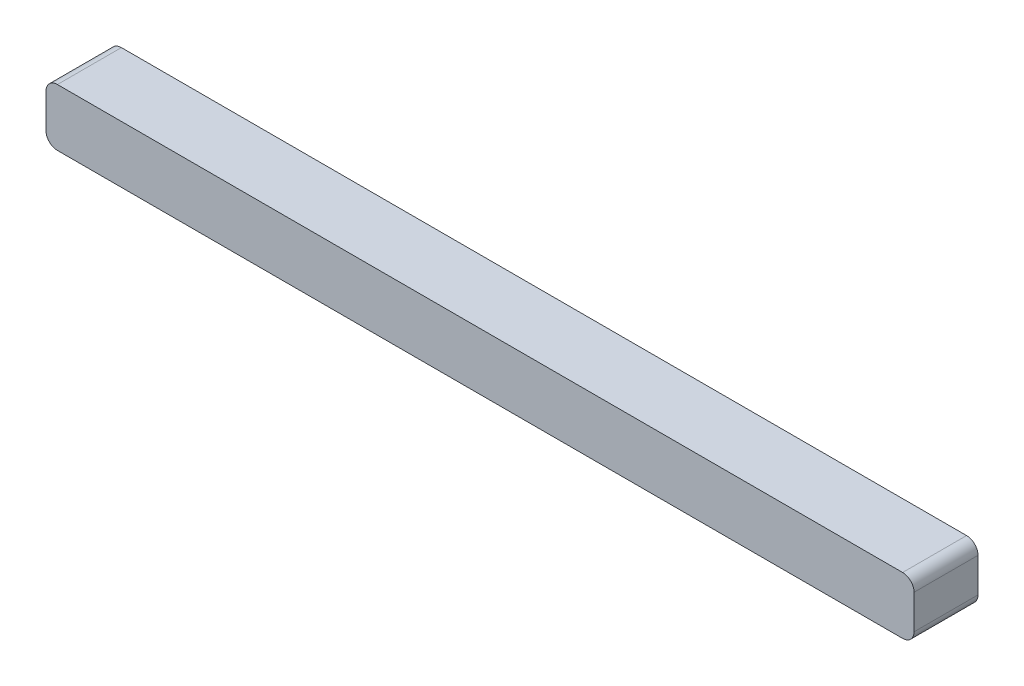
ISO-10303-21;
HEADER;
FILE_DESCRIPTION(('STEP AP214'),'2;1');
FILE_NAME('part.step','',(''),(''),'','','');
FILE_SCHEMA(('AUTOMOTIVE_DESIGN { 1 0 10303 214 1 1 1 1 }'));
ENDSEC;
DATA;
#1=APPLICATION_CONTEXT('core data for automotive mechanical design processes');
#2=APPLICATION_PROTOCOL_DEFINITION('international standard','automotive_design',2000,#1);
#3=PRODUCT_CONTEXT('',#1,'mechanical');
#4=PRODUCT('Part','Part','',(#3));
#5=PRODUCT_RELATED_PRODUCT_CATEGORY('part','',(#4));
#6=PRODUCT_DEFINITION_FORMATION('','',#4);
#7=PRODUCT_DEFINITION_CONTEXT('part definition',#1,'design');
#8=PRODUCT_DEFINITION('design','',#6,#7);
#9=PRODUCT_DEFINITION_SHAPE('','',#8);
#10=(LENGTH_UNIT() NAMED_UNIT(*) SI_UNIT(.MILLI.,.METRE.));
#11=(NAMED_UNIT(*) PLANE_ANGLE_UNIT() SI_UNIT($,.RADIAN.));
#12=(NAMED_UNIT(*) SI_UNIT($,.STERADIAN.) SOLID_ANGLE_UNIT());
#13=UNCERTAINTY_MEASURE_WITH_UNIT(LENGTH_MEASURE(1.E-05),#10,'distance_accuracy_value','');
#14=(GEOMETRIC_REPRESENTATION_CONTEXT(3) GLOBAL_UNCERTAINTY_ASSIGNED_CONTEXT((#13)) GLOBAL_UNIT_ASSIGNED_CONTEXT((#10,
#11,#12)) REPRESENTATION_CONTEXT('',''));
#15=CARTESIAN_POINT('',(0.,0.,0.));
#16=DIRECTION('',(0.,0.,1.));
#17=DIRECTION('',(1.,0.,0.));
#18=AXIS2_PLACEMENT_3D('',#15,#16,#17);
#19=CARTESIAN_POINT('',(-18.7,1.35,2.8));
#20=DIRECTION('',(1.,0.,0.));
#21=DIRECTION('',(0.,0.,-1.));
#22=AXIS2_PLACEMENT_3D('',#19,#20,#21);
#23=PLANE('',#22);
#24=DIRECTION('',(0.,-1.,0.));
#25=VECTOR('',#24,1.);
#26=CARTESIAN_POINT('',(-18.7,1.35,0.));
#27=LINE('',#26,#25);
#28=CARTESIAN_POINT('',(-18.7,0.85,0.));
#29=VERTEX_POINT('',#28);
#30=CARTESIAN_POINT('',(-18.7,-0.65,0.));
#31=VERTEX_POINT('',#30);
#32=EDGE_CURVE('E142',#29,#31,#27,.T.);
#33=ORIENTED_EDGE('',*,*,#32,.T.);
#34=DIRECTION('',(0.,0.,-1.));
#35=VECTOR('',#34,1.);
#36=CARTESIAN_POINT('',(-18.7,-0.65,2.8));
#37=LINE('',#36,#35);
#38=CARTESIAN_POINT('',(-18.7,-0.65,2.8));
#39=VERTEX_POINT('',#38);
#40=EDGE_CURVE('E116',#31,#39,#37,.F.);
#41=ORIENTED_EDGE('',*,*,#40,.T.);
#42=DIRECTION('',(0.,-1.,0.));
#43=VECTOR('',#42,1.);
#44=CARTESIAN_POINT('',(-18.7,1.35,2.8));
#45=LINE('',#44,#43);
#46=CARTESIAN_POINT('',(-18.7,0.85,2.8));
#47=VERTEX_POINT('',#46);
#48=EDGE_CURVE('E154',#47,#39,#45,.T.);
#49=ORIENTED_EDGE('',*,*,#48,.F.);
#50=DIRECTION('',(0.,0.,-1.));
#51=VECTOR('',#50,1.);
#52=CARTESIAN_POINT('',(-18.7,0.85,2.8));
#53=LINE('',#52,#51);
#54=EDGE_CURVE('E122',#47,#29,#53,.T.);
#55=ORIENTED_EDGE('',*,*,#54,.T.);
#56=EDGE_LOOP('',(#33,#41,#49,#55));
#57=FACE_BOUND('',#56,.T.);
#58=ADVANCED_FACE('F43',(#57),#23,.F.);
#59=CARTESIAN_POINT('',(-18.7,-1.15,2.8));
#60=DIRECTION('',(0.,1.,0.));
#61=DIRECTION('',(0.,0.,1.));
#62=AXIS2_PLACEMENT_3D('',#59,#60,#61);
#63=PLANE('',#62);
#64=DIRECTION('',(1.,0.,0.));
#65=VECTOR('',#64,1.);
#66=CARTESIAN_POINT('',(-18.7,-1.15,2.8));
#67=LINE('',#66,#65);
#68=CARTESIAN_POINT('',(-18.2,-1.15,2.8));
#69=VERTEX_POINT('',#68);
#70=CARTESIAN_POINT('',(18.8,-1.15,2.8));
#71=VERTEX_POINT('',#70);
#72=EDGE_CURVE('E132',#69,#71,#67,.T.);
#73=ORIENTED_EDGE('',*,*,#72,.F.);
#74=DIRECTION('',(0.,0.,-1.));
#75=VECTOR('',#74,1.);
#76=CARTESIAN_POINT('',(-18.2,-1.15,2.8));
#77=LINE('',#76,#75);
#78=CARTESIAN_POINT('',(-18.2,-1.15,0.));
#79=VERTEX_POINT('',#78);
#80=EDGE_CURVE('E115',#69,#79,#77,.T.);
#81=ORIENTED_EDGE('',*,*,#80,.T.);
#82=DIRECTION('',(1.,0.,0.));
#83=VECTOR('',#82,1.);
#84=CARTESIAN_POINT('',(-18.7,-1.15,0.));
#85=LINE('',#84,#83);
#86=CARTESIAN_POINT('',(18.8,-1.15,0.));
#87=VERTEX_POINT('',#86);
#88=EDGE_CURVE('E129',#79,#87,#85,.T.);
#89=ORIENTED_EDGE('',*,*,#88,.T.);
#90=DIRECTION('',(0.,0.,-1.));
#91=VECTOR('',#90,1.);
#92=CARTESIAN_POINT('',(18.8,-1.15,2.8));
#93=LINE('',#92,#91);
#94=EDGE_CURVE('E135',#87,#71,#93,.F.);
#95=ORIENTED_EDGE('',*,*,#94,.T.);
#96=EDGE_LOOP('',(#73,#81,#89,#95));
#97=FACE_BOUND('',#96,.T.);
#98=ADVANCED_FACE('F128',(#97),#63,.F.);
#99=CARTESIAN_POINT('',(19.3,1.35,2.8));
#100=DIRECTION('',(-1.,0.,0.));
#101=DIRECTION('',(0.,0.,1.));
#102=AXIS2_PLACEMENT_3D('',#99,#100,#101);
#103=PLANE('',#102);
#104=DIRECTION('',(0.,1.,0.));
#105=VECTOR('',#104,1.);
#106=CARTESIAN_POINT('',(19.3,1.35,2.8));
#107=LINE('',#106,#105);
#108=CARTESIAN_POINT('',(19.3,-0.65,2.8));
#109=VERTEX_POINT('',#108);
#110=CARTESIAN_POINT('',(19.3,0.85,2.8));
#111=VERTEX_POINT('',#110);
#112=EDGE_CURVE('E190',#109,#111,#107,.T.);
#113=ORIENTED_EDGE('',*,*,#112,.F.);
#114=DIRECTION('',(0.,0.,-1.));
#115=VECTOR('',#114,1.);
#116=CARTESIAN_POINT('',(19.3,-0.65,2.8));
#117=LINE('',#116,#115);
#118=CARTESIAN_POINT('',(19.3,-0.65,0.));
#119=VERTEX_POINT('',#118);
#120=EDGE_CURVE('E11',#109,#119,#117,.T.);
#121=ORIENTED_EDGE('',*,*,#120,.T.);
#122=DIRECTION('',(0.,1.,0.));
#123=VECTOR('',#122,1.);
#124=CARTESIAN_POINT('',(19.3,1.35,0.));
#125=LINE('',#124,#123);
#126=CARTESIAN_POINT('',(19.3,0.85,0.));
#127=VERTEX_POINT('',#126);
#128=EDGE_CURVE('E141',#119,#127,#125,.T.);
#129=ORIENTED_EDGE('',*,*,#128,.T.);
#130=DIRECTION('',(0.,0.,-1.));
#131=VECTOR('',#130,1.);
#132=CARTESIAN_POINT('',(19.3,0.85,2.8));
#133=LINE('',#132,#131);
#134=EDGE_CURVE('E52',#127,#111,#133,.F.);
#135=ORIENTED_EDGE('',*,*,#134,.T.);
#136=EDGE_LOOP('',(#113,#121,#129,#135));
#137=FACE_BOUND('',#136,.T.);
#138=ADVANCED_FACE('F189',(#137),#103,.F.);
#139=CARTESIAN_POINT('',(-18.7,1.35,2.8));
#140=DIRECTION('',(0.,-1.,0.));
#141=DIRECTION('',(0.,0.,-1.));
#142=AXIS2_PLACEMENT_3D('',#139,#140,#141);
#143=PLANE('',#142);
#144=DIRECTION('',(-1.,0.,0.));
#145=VECTOR('',#144,1.);
#146=CARTESIAN_POINT('',(-18.7,1.35,0.));
#147=LINE('',#146,#145);
#148=CARTESIAN_POINT('',(18.8,1.35,0.));
#149=VERTEX_POINT('',#148);
#150=CARTESIAN_POINT('',(-18.2,1.35,0.));
#151=VERTEX_POINT('',#150);
#152=EDGE_CURVE('E147',#149,#151,#147,.T.);
#153=ORIENTED_EDGE('',*,*,#152,.T.);
#154=DIRECTION('',(0.,0.,-1.));
#155=VECTOR('',#154,1.);
#156=CARTESIAN_POINT('',(-18.2,1.35,2.8));
#157=LINE('',#156,#155);
#158=CARTESIAN_POINT('',(-18.2,1.35,2.8));
#159=VERTEX_POINT('',#158);
#160=EDGE_CURVE('E59',#151,#159,#157,.F.);
#161=ORIENTED_EDGE('',*,*,#160,.T.);
#162=DIRECTION('',(-1.,0.,0.));
#163=VECTOR('',#162,1.);
#164=CARTESIAN_POINT('',(-18.7,1.35,2.8));
#165=LINE('',#164,#163);
#166=CARTESIAN_POINT('',(18.8,1.35,2.8));
#167=VERTEX_POINT('',#166);
#168=EDGE_CURVE('E156',#167,#159,#165,.T.);
#169=ORIENTED_EDGE('',*,*,#168,.F.);
#170=DIRECTION('',(0.,0.,-1.));
#171=VECTOR('',#170,1.);
#172=CARTESIAN_POINT('',(18.8,1.35,2.8));
#173=LINE('',#172,#171);
#174=EDGE_CURVE('E180',#167,#149,#173,.T.);
#175=ORIENTED_EDGE('',*,*,#174,.T.);
#176=EDGE_LOOP('',(#153,#161,#169,#175));
#177=FACE_BOUND('',#176,.T.);
#178=ADVANCED_FACE('F200',(#177),#143,.F.);
#179=CARTESIAN_POINT('',(0.,0.,2.8));
#180=DIRECTION('',(0.,0.,1.));
#181=DIRECTION('',(1.,0.,0.));
#182=AXIS2_PLACEMENT_3D('',#179,#180,#181);
#183=PLANE('',#182);
#184=ORIENTED_EDGE('',*,*,#48,.T.);
#185=CARTESIAN_POINT('',(-18.2,-0.65,2.8));
#186=DIRECTION('',(0.,0.,1.));
#187=DIRECTION('',(1.,0.,0.));
#188=AXIS2_PLACEMENT_3D('',#185,#186,#187);
#189=CIRCLE('',#188,0.5);
#190=EDGE_CURVE('E177',#39,#69,#189,.T.);
#191=ORIENTED_EDGE('',*,*,#190,.T.);
#192=ORIENTED_EDGE('',*,*,#72,.T.);
#193=CARTESIAN_POINT('',(18.8,-0.65,2.8));
#194=DIRECTION('',(0.,0.,1.));
#195=DIRECTION('',(1.,0.,0.));
#196=AXIS2_PLACEMENT_3D('',#193,#194,#195);
#197=CIRCLE('',#196,0.5);
#198=EDGE_CURVE('E171',#71,#109,#197,.T.);
#199=ORIENTED_EDGE('',*,*,#198,.T.);
#200=ORIENTED_EDGE('',*,*,#112,.T.);
#201=CARTESIAN_POINT('',(18.8,0.85,2.8));
#202=DIRECTION('',(0.,0.,1.));
#203=DIRECTION('',(1.,0.,0.));
#204=AXIS2_PLACEMENT_3D('',#201,#202,#203);
#205=CIRCLE('',#204,0.5);
#206=EDGE_CURVE('E66',#111,#167,#205,.T.);
#207=ORIENTED_EDGE('',*,*,#206,.T.);
#208=ORIENTED_EDGE('',*,*,#168,.T.);
#209=CARTESIAN_POINT('',(-18.2,0.85,2.8));
#210=DIRECTION('',(0.,0.,1.));
#211=DIRECTION('',(1.,0.,0.));
#212=AXIS2_PLACEMENT_3D('',#209,#210,#211);
#213=CIRCLE('',#212,0.5);
#214=EDGE_CURVE('E174',#159,#47,#213,.T.);
#215=ORIENTED_EDGE('',*,*,#214,.T.);
#216=EDGE_LOOP('',(#184,#191,#192,#199,#200,#207,#208,#215));
#217=FACE_BOUND('',#216,.T.);
#218=ADVANCED_FACE('F194',(#217),#183,.T.);
#219=CARTESIAN_POINT('',(0.,0.,0.));
#220=DIRECTION('',(0.,0.,1.));
#221=DIRECTION('',(1.,0.,0.));
#222=AXIS2_PLACEMENT_3D('',#219,#220,#221);
#223=PLANE('',#222);
#224=ORIENTED_EDGE('',*,*,#88,.F.);
#225=CARTESIAN_POINT('',(-18.2,-0.65,0.));
#226=DIRECTION('',(0.,0.,1.));
#227=DIRECTION('',(1.,0.,0.));
#228=AXIS2_PLACEMENT_3D('',#225,#226,#227);
#229=CIRCLE('',#228,0.5);
#230=EDGE_CURVE('E111',#79,#31,#229,.F.);
#231=ORIENTED_EDGE('',*,*,#230,.T.);
#232=ORIENTED_EDGE('',*,*,#32,.F.);
#233=CARTESIAN_POINT('',(-18.2,0.85,0.));
#234=DIRECTION('',(0.,0.,1.));
#235=DIRECTION('',(1.,0.,0.));
#236=AXIS2_PLACEMENT_3D('',#233,#234,#235);
#237=CIRCLE('',#236,0.5);
#238=EDGE_CURVE('E123',#29,#151,#237,.F.);
#239=ORIENTED_EDGE('',*,*,#238,.T.);
#240=ORIENTED_EDGE('',*,*,#152,.F.);
#241=CARTESIAN_POINT('',(18.8,0.85,0.));
#242=DIRECTION('',(0.,0.,1.));
#243=DIRECTION('',(1.,0.,0.));
#244=AXIS2_PLACEMENT_3D('',#241,#242,#243);
#245=CIRCLE('',#244,0.5);
#246=EDGE_CURVE('E134',#149,#127,#245,.F.);
#247=ORIENTED_EDGE('',*,*,#246,.T.);
#248=ORIENTED_EDGE('',*,*,#128,.F.);
#249=CARTESIAN_POINT('',(18.8,-0.65,0.));
#250=DIRECTION('',(0.,0.,1.));
#251=DIRECTION('',(1.,0.,0.));
#252=AXIS2_PLACEMENT_3D('',#249,#250,#251);
#253=CIRCLE('',#252,0.5);
#254=EDGE_CURVE('E139',#119,#87,#253,.F.);
#255=ORIENTED_EDGE('',*,*,#254,.T.);
#256=EDGE_LOOP('',(#224,#231,#232,#239,#240,#247,#248,#255));
#257=FACE_BOUND('',#256,.T.);
#258=ADVANCED_FACE('F137',(#257),#223,.F.);
#259=CARTESIAN_POINT('',(-18.2,-0.65,2.8));
#260=DIRECTION('',(0.,0.,-1.));
#261=DIRECTION('',(-1.,0.,0.));
#262=AXIS2_PLACEMENT_3D('',#259,#260,#261);
#263=CYLINDRICAL_SURFACE('',#262,0.5);
#264=ORIENTED_EDGE('',*,*,#190,.F.);
#265=ORIENTED_EDGE('',*,*,#40,.F.);
#266=ORIENTED_EDGE('',*,*,#230,.F.);
#267=ORIENTED_EDGE('',*,*,#80,.F.);
#268=EDGE_LOOP('',(#264,#265,#266,#267));
#269=FACE_BOUND('',#268,.T.);
#270=ADVANCED_FACE('F114',(#269),#263,.T.);
#271=CARTESIAN_POINT('',(-18.2,0.85,2.8));
#272=DIRECTION('',(0.,0.,-1.));
#273=DIRECTION('',(-1.,0.,0.));
#274=AXIS2_PLACEMENT_3D('',#271,#272,#273);
#275=CYLINDRICAL_SURFACE('',#274,0.5);
#276=ORIENTED_EDGE('',*,*,#214,.F.);
#277=ORIENTED_EDGE('',*,*,#160,.F.);
#278=ORIENTED_EDGE('',*,*,#238,.F.);
#279=ORIENTED_EDGE('',*,*,#54,.F.);
#280=EDGE_LOOP('',(#276,#277,#278,#279));
#281=FACE_BOUND('',#280,.T.);
#282=ADVANCED_FACE('F204',(#281),#275,.T.);
#283=CARTESIAN_POINT('',(18.8,-0.65,2.8));
#284=DIRECTION('',(0.,0.,-1.));
#285=DIRECTION('',(-1.,0.,0.));
#286=AXIS2_PLACEMENT_3D('',#283,#284,#285);
#287=CYLINDRICAL_SURFACE('',#286,0.5);
#288=ORIENTED_EDGE('',*,*,#198,.F.);
#289=ORIENTED_EDGE('',*,*,#94,.F.);
#290=ORIENTED_EDGE('',*,*,#254,.F.);
#291=ORIENTED_EDGE('',*,*,#120,.F.);
#292=EDGE_LOOP('',(#288,#289,#290,#291));
#293=FACE_BOUND('',#292,.T.);
#294=ADVANCED_FACE('F213',(#293),#287,.T.);
#295=CARTESIAN_POINT('',(18.8,0.85,2.8));
#296=DIRECTION('',(0.,0.,-1.));
#297=DIRECTION('',(-1.,0.,0.));
#298=AXIS2_PLACEMENT_3D('',#295,#296,#297);
#299=CYLINDRICAL_SURFACE('',#298,0.5);
#300=ORIENTED_EDGE('',*,*,#206,.F.);
#301=ORIENTED_EDGE('',*,*,#134,.F.);
#302=ORIENTED_EDGE('',*,*,#246,.F.);
#303=ORIENTED_EDGE('',*,*,#174,.F.);
#304=EDGE_LOOP('',(#300,#301,#302,#303));
#305=FACE_BOUND('',#304,.T.);
#306=ADVANCED_FACE('F45',(#305),#299,.T.);
#307=CLOSED_SHELL('',(#58,#98,#138,#178,#218,#258,#270,#282,#294,#306));
#308=MANIFOLD_SOLID_BREP('B2',#307);
#309=ADVANCED_BREP_SHAPE_REPRESENTATION('',(#18,#308),#14);
#310=SHAPE_DEFINITION_REPRESENTATION(#9,#309);
ENDSEC;
END-ISO-10303-21;
